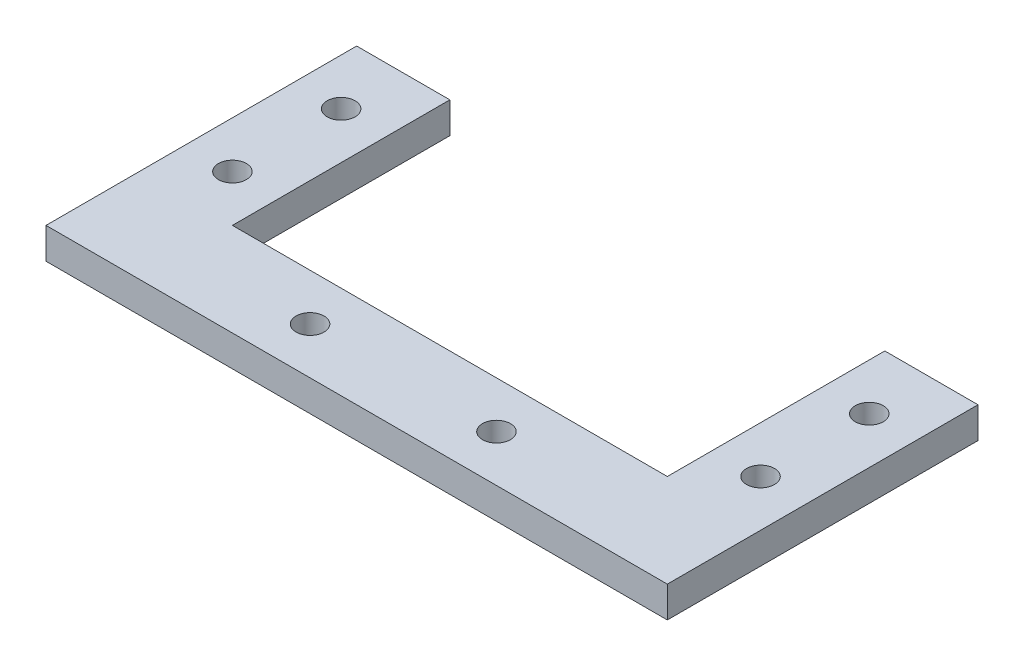
ISO-10303-21;
HEADER;
FILE_DESCRIPTION(('STEP AP214'),'2;1');
FILE_NAME('part.step','',(''),(''),'','','');
FILE_SCHEMA(('AUTOMOTIVE_DESIGN { 1 0 10303 214 1 1 1 1 }'));
ENDSEC;
DATA;
#1=APPLICATION_CONTEXT('core data for automotive mechanical design processes');
#2=APPLICATION_PROTOCOL_DEFINITION('international standard','automotive_design',2000,#1);
#3=PRODUCT_CONTEXT('',#1,'mechanical');
#4=PRODUCT('Part','Part','',(#3));
#5=PRODUCT_RELATED_PRODUCT_CATEGORY('part','',(#4));
#6=PRODUCT_DEFINITION_FORMATION('','',#4);
#7=PRODUCT_DEFINITION_CONTEXT('part definition',#1,'design');
#8=PRODUCT_DEFINITION('design','',#6,#7);
#9=PRODUCT_DEFINITION_SHAPE('','',#8);
#10=(LENGTH_UNIT() NAMED_UNIT(*) SI_UNIT(.MILLI.,.METRE.));
#11=(NAMED_UNIT(*) PLANE_ANGLE_UNIT() SI_UNIT($,.RADIAN.));
#12=(NAMED_UNIT(*) SI_UNIT($,.STERADIAN.) SOLID_ANGLE_UNIT());
#13=UNCERTAINTY_MEASURE_WITH_UNIT(LENGTH_MEASURE(1.E-05),#10,'distance_accuracy_value','');
#14=(GEOMETRIC_REPRESENTATION_CONTEXT(3) GLOBAL_UNCERTAINTY_ASSIGNED_CONTEXT((#13)) GLOBAL_UNIT_ASSIGNED_CONTEXT((#10,
#11,#12)) REPRESENTATION_CONTEXT('',''));
#15=CARTESIAN_POINT('',(0.,0.,0.));
#16=DIRECTION('',(0.,0.,1.));
#17=DIRECTION('',(1.,0.,0.));
#18=AXIS2_PLACEMENT_3D('',#15,#16,#17);
#19=CARTESIAN_POINT('',(0.,10.,0.));
#20=DIRECTION('',(0.,-1.,0.));
#21=DIRECTION('',(0.,0.,-1.));
#22=AXIS2_PLACEMENT_3D('',#19,#20,#21);
#23=PLANE('',#22);
#24=DIRECTION('',(0.,0.,-1.));
#25=VECTOR('',#24,1.);
#26=CARTESIAN_POINT('',(0.,10.,-100.));
#27=LINE('',#26,#25);
#28=CARTESIAN_POINT('',(0.,10.,0.));
#29=VERTEX_POINT('',#28);
#30=CARTESIAN_POINT('',(0.,10.,-100.));
#31=VERTEX_POINT('',#30);
#32=EDGE_CURVE('E148',#29,#31,#27,.T.);
#33=ORIENTED_EDGE('',*,*,#32,.T.);
#34=DIRECTION('',(-1.,0.,0.));
#35=VECTOR('',#34,1.);
#36=CARTESIAN_POINT('',(-30.,10.,-100.));
#37=LINE('',#36,#35);
#38=CARTESIAN_POINT('',(-30.,10.,-100.));
#39=VERTEX_POINT('',#38);
#40=EDGE_CURVE('E96',#31,#39,#37,.T.);
#41=ORIENTED_EDGE('',*,*,#40,.T.);
#42=DIRECTION('',(0.,0.,1.));
#43=VECTOR('',#42,1.);
#44=CARTESIAN_POINT('',(-30.,10.,-30.));
#45=LINE('',#44,#43);
#46=CARTESIAN_POINT('',(-30.,10.,-30.));
#47=VERTEX_POINT('',#46);
#48=EDGE_CURVE('E163',#39,#47,#45,.T.);
#49=ORIENTED_EDGE('',*,*,#48,.T.);
#50=DIRECTION('',(-1.,0.,0.));
#51=VECTOR('',#50,1.);
#52=CARTESIAN_POINT('',(-170.,10.,-30.));
#53=LINE('',#52,#51);
#54=CARTESIAN_POINT('',(-170.,10.,-30.));
#55=VERTEX_POINT('',#54);
#56=EDGE_CURVE('E176',#47,#55,#53,.T.);
#57=ORIENTED_EDGE('',*,*,#56,.T.);
#58=DIRECTION('',(0.,0.,-1.));
#59=VECTOR('',#58,1.);
#60=CARTESIAN_POINT('',(-170.,10.,-100.));
#61=LINE('',#60,#59);
#62=CARTESIAN_POINT('',(-170.,10.,-100.));
#63=VERTEX_POINT('',#62);
#64=EDGE_CURVE('E115',#55,#63,#61,.T.);
#65=ORIENTED_EDGE('',*,*,#64,.T.);
#66=DIRECTION('',(-1.,0.,0.));
#67=VECTOR('',#66,1.);
#68=CARTESIAN_POINT('',(-200.,10.,-100.));
#69=LINE('',#68,#67);
#70=CARTESIAN_POINT('',(-200.,10.,-100.));
#71=VERTEX_POINT('',#70);
#72=EDGE_CURVE('E109',#63,#71,#69,.T.);
#73=ORIENTED_EDGE('',*,*,#72,.T.);
#74=DIRECTION('',(0.,0.,1.));
#75=VECTOR('',#74,1.);
#76=CARTESIAN_POINT('',(-200.,10.,0.));
#77=LINE('',#76,#75);
#78=CARTESIAN_POINT('',(-200.,10.,0.));
#79=VERTEX_POINT('',#78);
#80=EDGE_CURVE('E113',#71,#79,#77,.T.);
#81=ORIENTED_EDGE('',*,*,#80,.T.);
#82=DIRECTION('',(1.,0.,0.));
#83=VECTOR('',#82,1.);
#84=CARTESIAN_POINT('',(0.,10.,0.));
#85=LINE('',#84,#83);
#86=EDGE_CURVE('E53',#79,#29,#85,.T.);
#87=ORIENTED_EDGE('',*,*,#86,.T.);
#88=EDGE_LOOP('',(#33,#41,#49,#57,#65,#73,#81,#87));
#89=FACE_BOUND('',#88,.T.);
#90=CARTESIAN_POINT('',(-15.,10.,-45.));
#91=DIRECTION('',(0.,1.,0.));
#92=DIRECTION('',(0.,0.,1.));
#93=AXIS2_PLACEMENT_3D('',#90,#91,#92);
#94=CIRCLE('',#93,4.5);
#95=CARTESIAN_POINT('',(-15.,10.,-40.5));
#96=VERTEX_POINT('',#95);
#97=EDGE_CURVE('E137',#96,#96,#94,.T.);
#98=ORIENTED_EDGE('',*,*,#97,.F.);
#99=EDGE_LOOP('',(#98));
#100=FACE_BOUND('',#99,.T.);
#101=CARTESIAN_POINT('',(-130.,10.,-15.));
#102=DIRECTION('',(0.,1.,0.));
#103=DIRECTION('',(0.,0.,1.));
#104=AXIS2_PLACEMENT_3D('',#101,#102,#103);
#105=CIRCLE('',#104,4.49999999999999);
#106=CARTESIAN_POINT('',(-130.,10.,-10.5));
#107=VERTEX_POINT('',#106);
#108=EDGE_CURVE('E185',#107,#107,#105,.T.);
#109=ORIENTED_EDGE('',*,*,#108,.F.);
#110=EDGE_LOOP('',(#109));
#111=FACE_BOUND('',#110,.T.);
#112=CARTESIAN_POINT('',(-70.,10.,-15.));
#113=DIRECTION('',(0.,1.,0.));
#114=DIRECTION('',(0.,0.,1.));
#115=AXIS2_PLACEMENT_3D('',#112,#113,#114);
#116=CIRCLE('',#115,4.5);
#117=CARTESIAN_POINT('',(-70.,10.,-10.5));
#118=VERTEX_POINT('',#117);
#119=EDGE_CURVE('E191',#118,#118,#116,.T.);
#120=ORIENTED_EDGE('',*,*,#119,.F.);
#121=EDGE_LOOP('',(#120));
#122=FACE_BOUND('',#121,.T.);
#123=CARTESIAN_POINT('',(-185.,10.,-80.));
#124=DIRECTION('',(0.,1.,0.));
#125=DIRECTION('',(0.,0.,1.));
#126=AXIS2_PLACEMENT_3D('',#123,#124,#125);
#127=CIRCLE('',#126,4.49999999999999);
#128=CARTESIAN_POINT('',(-185.,10.,-75.5));
#129=VERTEX_POINT('',#128);
#130=EDGE_CURVE('E197',#129,#129,#127,.T.);
#131=ORIENTED_EDGE('',*,*,#130,.F.);
#132=EDGE_LOOP('',(#131));
#133=FACE_BOUND('',#132,.T.);
#134=CARTESIAN_POINT('',(-185.,10.,-45.));
#135=DIRECTION('',(0.,1.,0.));
#136=DIRECTION('',(0.,0.,1.));
#137=AXIS2_PLACEMENT_3D('',#134,#135,#136);
#138=CIRCLE('',#137,4.49999999999999);
#139=CARTESIAN_POINT('',(-185.,10.,-40.5));
#140=VERTEX_POINT('',#139);
#141=EDGE_CURVE('E203',#140,#140,#138,.T.);
#142=ORIENTED_EDGE('',*,*,#141,.F.);
#143=EDGE_LOOP('',(#142));
#144=FACE_BOUND('',#143,.T.);
#145=CARTESIAN_POINT('',(-15.,10.,-80.));
#146=DIRECTION('',(0.,1.,0.));
#147=DIRECTION('',(0.,0.,1.));
#148=AXIS2_PLACEMENT_3D('',#145,#146,#147);
#149=CIRCLE('',#148,4.5);
#150=CARTESIAN_POINT('',(-15.,10.,-75.5));
#151=VERTEX_POINT('',#150);
#152=EDGE_CURVE('E209',#151,#151,#149,.T.);
#153=ORIENTED_EDGE('',*,*,#152,.F.);
#154=EDGE_LOOP('',(#153));
#155=FACE_BOUND('',#154,.T.);
#156=ADVANCED_FACE('F36',(#89,#100,#111,#122,#133,#144,#155),#23,.F.);
#157=CARTESIAN_POINT('',(0.,0.,0.));
#158=DIRECTION('',(0.,-1.,0.));
#159=DIRECTION('',(0.,0.,-1.));
#160=AXIS2_PLACEMENT_3D('',#157,#158,#159);
#161=PLANE('',#160);
#162=CARTESIAN_POINT('',(-185.,0.,-45.));
#163=DIRECTION('',(0.,1.,0.));
#164=DIRECTION('',(0.,0.,1.));
#165=AXIS2_PLACEMENT_3D('',#162,#163,#164);
#166=CIRCLE('',#165,4.49999999999999);
#167=CARTESIAN_POINT('',(-185.,0.,-40.5));
#168=VERTEX_POINT('',#167);
#169=EDGE_CURVE('E206',#168,#168,#166,.T.);
#170=ORIENTED_EDGE('',*,*,#169,.T.);
#171=EDGE_LOOP('',(#170));
#172=FACE_BOUND('',#171,.T.);
#173=CARTESIAN_POINT('',(-70.,0.,-15.));
#174=DIRECTION('',(0.,1.,0.));
#175=DIRECTION('',(0.,0.,1.));
#176=AXIS2_PLACEMENT_3D('',#173,#174,#175);
#177=CIRCLE('',#176,4.5);
#178=CARTESIAN_POINT('',(-70.,0.,-10.5));
#179=VERTEX_POINT('',#178);
#180=EDGE_CURVE('E194',#179,#179,#177,.T.);
#181=ORIENTED_EDGE('',*,*,#180,.T.);
#182=EDGE_LOOP('',(#181));
#183=FACE_BOUND('',#182,.T.);
#184=CARTESIAN_POINT('',(-15.,0.,-45.));
#185=DIRECTION('',(0.,1.,0.));
#186=DIRECTION('',(0.,0.,1.));
#187=AXIS2_PLACEMENT_3D('',#184,#185,#186);
#188=CIRCLE('',#187,4.5);
#189=CARTESIAN_POINT('',(-15.,0.,-40.5));
#190=VERTEX_POINT('',#189);
#191=EDGE_CURVE('E182',#190,#190,#188,.T.);
#192=ORIENTED_EDGE('',*,*,#191,.T.);
#193=EDGE_LOOP('',(#192));
#194=FACE_BOUND('',#193,.T.);
#195=DIRECTION('',(0.,0.,-1.));
#196=VECTOR('',#195,1.);
#197=CARTESIAN_POINT('',(0.,0.,-100.));
#198=LINE('',#197,#196);
#199=CARTESIAN_POINT('',(0.,0.,0.));
#200=VERTEX_POINT('',#199);
#201=CARTESIAN_POINT('',(0.,0.,-100.));
#202=VERTEX_POINT('',#201);
#203=EDGE_CURVE('E133',#200,#202,#198,.T.);
#204=ORIENTED_EDGE('',*,*,#203,.F.);
#205=DIRECTION('',(1.,0.,0.));
#206=VECTOR('',#205,1.);
#207=CARTESIAN_POINT('',(0.,0.,0.));
#208=LINE('',#207,#206);
#209=CARTESIAN_POINT('',(-200.,0.,0.));
#210=VERTEX_POINT('',#209);
#211=EDGE_CURVE('E88',#210,#200,#208,.T.);
#212=ORIENTED_EDGE('',*,*,#211,.F.);
#213=DIRECTION('',(0.,0.,1.));
#214=VECTOR('',#213,1.);
#215=CARTESIAN_POINT('',(-200.,0.,0.));
#216=LINE('',#215,#214);
#217=CARTESIAN_POINT('',(-200.,0.,-100.));
#218=VERTEX_POINT('',#217);
#219=EDGE_CURVE('E82',#218,#210,#216,.T.);
#220=ORIENTED_EDGE('',*,*,#219,.F.);
#221=DIRECTION('',(-1.,0.,0.));
#222=VECTOR('',#221,1.);
#223=CARTESIAN_POINT('',(-200.,0.,-100.));
#224=LINE('',#223,#222);
#225=CARTESIAN_POINT('',(-170.,0.,-100.));
#226=VERTEX_POINT('',#225);
#227=EDGE_CURVE('E123',#226,#218,#224,.T.);
#228=ORIENTED_EDGE('',*,*,#227,.F.);
#229=DIRECTION('',(0.,0.,-1.));
#230=VECTOR('',#229,1.);
#231=CARTESIAN_POINT('',(-170.,0.,-100.));
#232=LINE('',#231,#230);
#233=CARTESIAN_POINT('',(-170.,0.,-30.));
#234=VERTEX_POINT('',#233);
#235=EDGE_CURVE('E143',#234,#226,#232,.T.);
#236=ORIENTED_EDGE('',*,*,#235,.F.);
#237=DIRECTION('',(-1.,0.,0.));
#238=VECTOR('',#237,1.);
#239=CARTESIAN_POINT('',(-170.,0.,-30.));
#240=LINE('',#239,#238);
#241=CARTESIAN_POINT('',(-30.,0.,-30.));
#242=VERTEX_POINT('',#241);
#243=EDGE_CURVE('E141',#242,#234,#240,.T.);
#244=ORIENTED_EDGE('',*,*,#243,.F.);
#245=DIRECTION('',(0.,0.,1.));
#246=VECTOR('',#245,1.);
#247=CARTESIAN_POINT('',(-30.,0.,-30.));
#248=LINE('',#247,#246);
#249=CARTESIAN_POINT('',(-30.,0.,-100.));
#250=VERTEX_POINT('',#249);
#251=EDGE_CURVE('E139',#250,#242,#248,.T.);
#252=ORIENTED_EDGE('',*,*,#251,.F.);
#253=DIRECTION('',(-1.,0.,0.));
#254=VECTOR('',#253,1.);
#255=CARTESIAN_POINT('',(-30.,0.,-100.));
#256=LINE('',#255,#254);
#257=EDGE_CURVE('E136',#202,#250,#256,.T.);
#258=ORIENTED_EDGE('',*,*,#257,.F.);
#259=EDGE_LOOP('',(#204,#212,#220,#228,#236,#244,#252,#258));
#260=FACE_BOUND('',#259,.T.);
#261=CARTESIAN_POINT('',(-130.,0.,-15.));
#262=DIRECTION('',(0.,1.,0.));
#263=DIRECTION('',(0.,0.,1.));
#264=AXIS2_PLACEMENT_3D('',#261,#262,#263);
#265=CIRCLE('',#264,4.49999999999999);
#266=CARTESIAN_POINT('',(-130.,0.,-10.5));
#267=VERTEX_POINT('',#266);
#268=EDGE_CURVE('E188',#267,#267,#265,.T.);
#269=ORIENTED_EDGE('',*,*,#268,.T.);
#270=EDGE_LOOP('',(#269));
#271=FACE_BOUND('',#270,.T.);
#272=CARTESIAN_POINT('',(-185.,0.,-80.));
#273=DIRECTION('',(0.,1.,0.));
#274=DIRECTION('',(0.,0.,1.));
#275=AXIS2_PLACEMENT_3D('',#272,#273,#274);
#276=CIRCLE('',#275,4.49999999999999);
#277=CARTESIAN_POINT('',(-185.,0.,-75.5));
#278=VERTEX_POINT('',#277);
#279=EDGE_CURVE('E200',#278,#278,#276,.T.);
#280=ORIENTED_EDGE('',*,*,#279,.T.);
#281=EDGE_LOOP('',(#280));
#282=FACE_BOUND('',#281,.T.);
#283=CARTESIAN_POINT('',(-15.,0.,-80.));
#284=DIRECTION('',(0.,1.,0.));
#285=DIRECTION('',(0.,0.,1.));
#286=AXIS2_PLACEMENT_3D('',#283,#284,#285);
#287=CIRCLE('',#286,4.5);
#288=CARTESIAN_POINT('',(-15.,0.,-75.5));
#289=VERTEX_POINT('',#288);
#290=EDGE_CURVE('E212',#289,#289,#287,.T.);
#291=ORIENTED_EDGE('',*,*,#290,.T.);
#292=EDGE_LOOP('',(#291));
#293=FACE_BOUND('',#292,.T.);
#294=ADVANCED_FACE('F167',(#172,#183,#194,#260,#271,#282,#293),#161,.T.);
#295=CARTESIAN_POINT('',(0.,10.,-100.));
#296=DIRECTION('',(-1.,0.,0.));
#297=DIRECTION('',(0.,0.,1.));
#298=AXIS2_PLACEMENT_3D('',#295,#296,#297);
#299=PLANE('',#298);
#300=ORIENTED_EDGE('',*,*,#203,.T.);
#301=DIRECTION('',(0.,-1.,0.));
#302=VECTOR('',#301,1.);
#303=CARTESIAN_POINT('',(0.,10.,-100.));
#304=LINE('',#303,#302);
#305=EDGE_CURVE('E11',#31,#202,#304,.T.);
#306=ORIENTED_EDGE('',*,*,#305,.F.);
#307=ORIENTED_EDGE('',*,*,#32,.F.);
#308=DIRECTION('',(0.,-1.,0.));
#309=VECTOR('',#308,1.);
#310=CARTESIAN_POINT('',(0.,10.,0.));
#311=LINE('',#310,#309);
#312=EDGE_CURVE('E129',#29,#200,#311,.T.);
#313=ORIENTED_EDGE('',*,*,#312,.T.);
#314=EDGE_LOOP('',(#300,#306,#307,#313));
#315=FACE_BOUND('',#314,.T.);
#316=ADVANCED_FACE('F38',(#315),#299,.F.);
#317=CARTESIAN_POINT('',(-30.,10.,-100.));
#318=DIRECTION('',(0.,0.,1.));
#319=DIRECTION('',(1.,0.,0.));
#320=AXIS2_PLACEMENT_3D('',#317,#318,#319);
#321=PLANE('',#320);
#322=ORIENTED_EDGE('',*,*,#257,.T.);
#323=DIRECTION('',(0.,-1.,0.));
#324=VECTOR('',#323,1.);
#325=CARTESIAN_POINT('',(-30.,10.,-100.));
#326=LINE('',#325,#324);
#327=EDGE_CURVE('E45',#39,#250,#326,.T.);
#328=ORIENTED_EDGE('',*,*,#327,.F.);
#329=ORIENTED_EDGE('',*,*,#40,.F.);
#330=ORIENTED_EDGE('',*,*,#305,.T.);
#331=EDGE_LOOP('',(#322,#328,#329,#330));
#332=FACE_BOUND('',#331,.T.);
#333=ADVANCED_FACE('F244',(#332),#321,.F.);
#334=CARTESIAN_POINT('',(-30.,10.,-30.));
#335=DIRECTION('',(1.,0.,0.));
#336=DIRECTION('',(0.,0.,-1.));
#337=AXIS2_PLACEMENT_3D('',#334,#335,#336);
#338=PLANE('',#337);
#339=ORIENTED_EDGE('',*,*,#251,.T.);
#340=DIRECTION('',(0.,-1.,0.));
#341=VECTOR('',#340,1.);
#342=CARTESIAN_POINT('',(-30.,10.,-30.));
#343=LINE('',#342,#341);
#344=EDGE_CURVE('E155',#47,#242,#343,.T.);
#345=ORIENTED_EDGE('',*,*,#344,.F.);
#346=ORIENTED_EDGE('',*,*,#48,.F.);
#347=ORIENTED_EDGE('',*,*,#327,.T.);
#348=EDGE_LOOP('',(#339,#345,#346,#347));
#349=FACE_BOUND('',#348,.T.);
#350=ADVANCED_FACE('F161',(#349),#338,.F.);
#351=CARTESIAN_POINT('',(-170.,10.,-30.));
#352=DIRECTION('',(0.,0.,1.));
#353=DIRECTION('',(1.,0.,0.));
#354=AXIS2_PLACEMENT_3D('',#351,#352,#353);
#355=PLANE('',#354);
#356=ORIENTED_EDGE('',*,*,#243,.T.);
#357=DIRECTION('',(0.,-1.,0.));
#358=VECTOR('',#357,1.);
#359=CARTESIAN_POINT('',(-170.,10.,-30.));
#360=LINE('',#359,#358);
#361=EDGE_CURVE('E152',#55,#234,#360,.T.);
#362=ORIENTED_EDGE('',*,*,#361,.F.);
#363=ORIENTED_EDGE('',*,*,#56,.F.);
#364=ORIENTED_EDGE('',*,*,#344,.T.);
#365=EDGE_LOOP('',(#356,#362,#363,#364));
#366=FACE_BOUND('',#365,.T.);
#367=ADVANCED_FACE('F172',(#366),#355,.F.);
#368=CARTESIAN_POINT('',(-170.,10.,-100.));
#369=DIRECTION('',(-1.,0.,0.));
#370=DIRECTION('',(0.,0.,1.));
#371=AXIS2_PLACEMENT_3D('',#368,#369,#370);
#372=PLANE('',#371);
#373=ORIENTED_EDGE('',*,*,#235,.T.);
#374=DIRECTION('',(0.,-1.,0.));
#375=VECTOR('',#374,1.);
#376=CARTESIAN_POINT('',(-170.,10.,-100.));
#377=LINE('',#376,#375);
#378=EDGE_CURVE('E124',#63,#226,#377,.T.);
#379=ORIENTED_EDGE('',*,*,#378,.F.);
#380=ORIENTED_EDGE('',*,*,#64,.F.);
#381=ORIENTED_EDGE('',*,*,#361,.T.);
#382=EDGE_LOOP('',(#373,#379,#380,#381));
#383=FACE_BOUND('',#382,.T.);
#384=ADVANCED_FACE('F175',(#383),#372,.F.);
#385=CARTESIAN_POINT('',(-200.,10.,-100.));
#386=DIRECTION('',(0.,0.,1.));
#387=DIRECTION('',(1.,0.,0.));
#388=AXIS2_PLACEMENT_3D('',#385,#386,#387);
#389=PLANE('',#388);
#390=ORIENTED_EDGE('',*,*,#227,.T.);
#391=DIRECTION('',(0.,-1.,0.));
#392=VECTOR('',#391,1.);
#393=CARTESIAN_POINT('',(-200.,10.,-100.));
#394=LINE('',#393,#392);
#395=EDGE_CURVE('E120',#71,#218,#394,.T.);
#396=ORIENTED_EDGE('',*,*,#395,.F.);
#397=ORIENTED_EDGE('',*,*,#72,.F.);
#398=ORIENTED_EDGE('',*,*,#378,.T.);
#399=EDGE_LOOP('',(#390,#396,#397,#398));
#400=FACE_BOUND('',#399,.T.);
#401=ADVANCED_FACE('F121',(#400),#389,.F.);
#402=CARTESIAN_POINT('',(-200.,10.,0.));
#403=DIRECTION('',(1.,0.,0.));
#404=DIRECTION('',(0.,0.,-1.));
#405=AXIS2_PLACEMENT_3D('',#402,#403,#404);
#406=PLANE('',#405);
#407=ORIENTED_EDGE('',*,*,#219,.T.);
#408=DIRECTION('',(0.,-1.,0.));
#409=VECTOR('',#408,1.);
#410=CARTESIAN_POINT('',(-200.,10.,0.));
#411=LINE('',#410,#409);
#412=EDGE_CURVE('E125',#79,#210,#411,.T.);
#413=ORIENTED_EDGE('',*,*,#412,.F.);
#414=ORIENTED_EDGE('',*,*,#80,.F.);
#415=ORIENTED_EDGE('',*,*,#395,.T.);
#416=EDGE_LOOP('',(#407,#413,#414,#415));
#417=FACE_BOUND('',#416,.T.);
#418=ADVANCED_FACE('F127',(#417),#406,.F.);
#419=CARTESIAN_POINT('',(0.,10.,0.));
#420=DIRECTION('',(0.,0.,-1.));
#421=DIRECTION('',(-1.,0.,0.));
#422=AXIS2_PLACEMENT_3D('',#419,#420,#421);
#423=PLANE('',#422);
#424=ORIENTED_EDGE('',*,*,#211,.T.);
#425=ORIENTED_EDGE('',*,*,#312,.F.);
#426=ORIENTED_EDGE('',*,*,#86,.F.);
#427=ORIENTED_EDGE('',*,*,#412,.T.);
#428=EDGE_LOOP('',(#424,#425,#426,#427));
#429=FACE_BOUND('',#428,.T.);
#430=ADVANCED_FACE('F232',(#429),#423,.F.);
#431=CARTESIAN_POINT('',(-15.,10.,-45.));
#432=DIRECTION('',(0.,-1.,0.));
#433=DIRECTION('',(0.,0.,-1.));
#434=AXIS2_PLACEMENT_3D('',#431,#432,#433);
#435=CYLINDRICAL_SURFACE('',#434,4.5);
#436=ORIENTED_EDGE('',*,*,#97,.T.);
#437=EDGE_LOOP('',(#436));
#438=FACE_BOUND('',#437,.T.);
#439=ORIENTED_EDGE('',*,*,#191,.F.);
#440=EDGE_LOOP('',(#439));
#441=FACE_BOUND('',#440,.T.);
#442=ADVANCED_FACE('F229',(#438,#441),#435,.F.);
#443=CARTESIAN_POINT('',(-130.,10.,-15.));
#444=DIRECTION('',(0.,-1.,0.));
#445=DIRECTION('',(0.,0.,-1.));
#446=AXIS2_PLACEMENT_3D('',#443,#444,#445);
#447=CYLINDRICAL_SURFACE('',#446,4.49999999999999);
#448=ORIENTED_EDGE('',*,*,#108,.T.);
#449=EDGE_LOOP('',(#448));
#450=FACE_BOUND('',#449,.T.);
#451=ORIENTED_EDGE('',*,*,#268,.F.);
#452=EDGE_LOOP('',(#451));
#453=FACE_BOUND('',#452,.T.);
#454=ADVANCED_FACE('F308',(#450,#453),#447,.F.);
#455=CARTESIAN_POINT('',(-70.,10.,-15.));
#456=DIRECTION('',(0.,-1.,0.));
#457=DIRECTION('',(0.,0.,-1.));
#458=AXIS2_PLACEMENT_3D('',#455,#456,#457);
#459=CYLINDRICAL_SURFACE('',#458,4.5);
#460=ORIENTED_EDGE('',*,*,#119,.T.);
#461=EDGE_LOOP('',(#460));
#462=FACE_BOUND('',#461,.T.);
#463=ORIENTED_EDGE('',*,*,#180,.F.);
#464=EDGE_LOOP('',(#463));
#465=FACE_BOUND('',#464,.T.);
#466=ADVANCED_FACE('F316',(#462,#465),#459,.F.);
#467=CARTESIAN_POINT('',(-185.,10.,-80.));
#468=DIRECTION('',(0.,-1.,0.));
#469=DIRECTION('',(0.,0.,-1.));
#470=AXIS2_PLACEMENT_3D('',#467,#468,#469);
#471=CYLINDRICAL_SURFACE('',#470,4.49999999999999);
#472=ORIENTED_EDGE('',*,*,#130,.T.);
#473=EDGE_LOOP('',(#472));
#474=FACE_BOUND('',#473,.T.);
#475=ORIENTED_EDGE('',*,*,#279,.F.);
#476=EDGE_LOOP('',(#475));
#477=FACE_BOUND('',#476,.T.);
#478=ADVANCED_FACE('F324',(#474,#477),#471,.F.);
#479=CARTESIAN_POINT('',(-185.,10.,-45.));
#480=DIRECTION('',(0.,-1.,0.));
#481=DIRECTION('',(0.,0.,-1.));
#482=AXIS2_PLACEMENT_3D('',#479,#480,#481);
#483=CYLINDRICAL_SURFACE('',#482,4.49999999999999);
#484=ORIENTED_EDGE('',*,*,#141,.T.);
#485=EDGE_LOOP('',(#484));
#486=FACE_BOUND('',#485,.T.);
#487=ORIENTED_EDGE('',*,*,#169,.F.);
#488=EDGE_LOOP('',(#487));
#489=FACE_BOUND('',#488,.T.);
#490=ADVANCED_FACE('F333',(#486,#489),#483,.F.);
#491=CARTESIAN_POINT('',(-15.,10.,-80.));
#492=DIRECTION('',(0.,-1.,0.));
#493=DIRECTION('',(0.,0.,-1.));
#494=AXIS2_PLACEMENT_3D('',#491,#492,#493);
#495=CYLINDRICAL_SURFACE('',#494,4.5);
#496=ORIENTED_EDGE('',*,*,#152,.T.);
#497=EDGE_LOOP('',(#496));
#498=FACE_BOUND('',#497,.T.);
#499=ORIENTED_EDGE('',*,*,#290,.F.);
#500=EDGE_LOOP('',(#499));
#501=FACE_BOUND('',#500,.T.);
#502=ADVANCED_FACE('F218',(#498,#501),#495,.F.);
#503=CLOSED_SHELL('',(#156,#294,#316,#333,#350,#367,#384,#401,#418,#430,#442,#454,#466,#478,
#490,#502));
#504=MANIFOLD_SOLID_BREP('B2',#503);
#505=ADVANCED_BREP_SHAPE_REPRESENTATION('',(#18,#504),#14);
#506=SHAPE_DEFINITION_REPRESENTATION(#9,#505);
ENDSEC;
END-ISO-10303-21;
